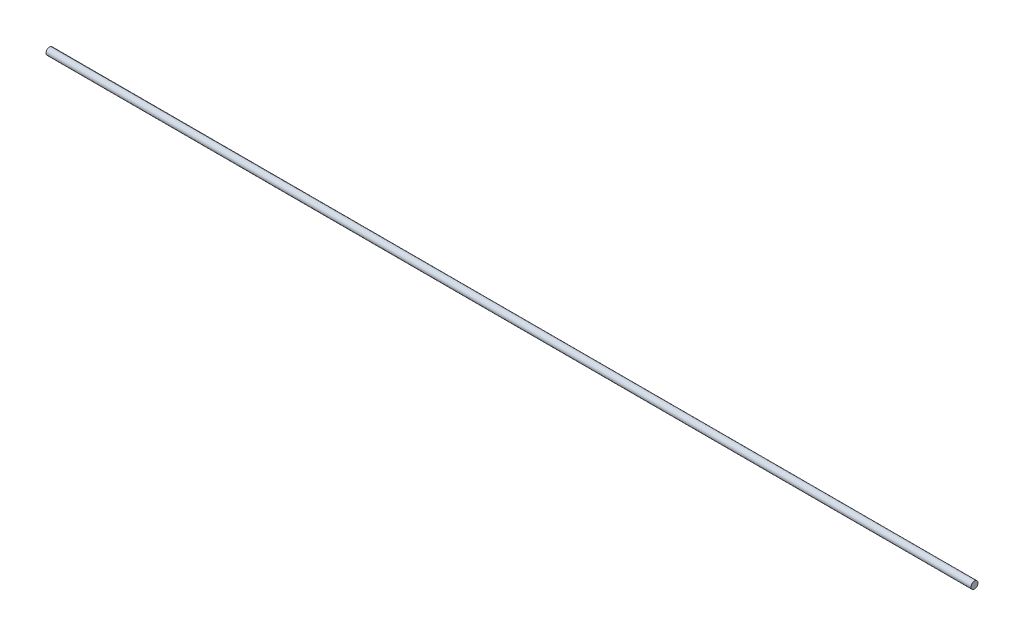
ISO-10303-21;
HEADER;
FILE_DESCRIPTION(('STEP AP214'),'2;1');
FILE_NAME('part.step','',(''),(''),'','','');
FILE_SCHEMA(('AUTOMOTIVE_DESIGN { 1 0 10303 214 1 1 1 1 }'));
ENDSEC;
DATA;
#1=APPLICATION_CONTEXT('core data for automotive mechanical design processes');
#2=APPLICATION_PROTOCOL_DEFINITION('international standard','automotive_design',2000,#1);
#3=PRODUCT_CONTEXT('',#1,'mechanical');
#4=PRODUCT('Part','Part','',(#3));
#5=PRODUCT_RELATED_PRODUCT_CATEGORY('part','',(#4));
#6=PRODUCT_DEFINITION_FORMATION('','',#4);
#7=PRODUCT_DEFINITION_CONTEXT('part definition',#1,'design');
#8=PRODUCT_DEFINITION('design','',#6,#7);
#9=PRODUCT_DEFINITION_SHAPE('','',#8);
#10=(LENGTH_UNIT() NAMED_UNIT(*) SI_UNIT(.MILLI.,.METRE.));
#11=(NAMED_UNIT(*) PLANE_ANGLE_UNIT() SI_UNIT($,.RADIAN.));
#12=(NAMED_UNIT(*) SI_UNIT($,.STERADIAN.) SOLID_ANGLE_UNIT());
#13=UNCERTAINTY_MEASURE_WITH_UNIT(LENGTH_MEASURE(1.E-05),#10,'distance_accuracy_value','');
#14=(GEOMETRIC_REPRESENTATION_CONTEXT(3) GLOBAL_UNCERTAINTY_ASSIGNED_CONTEXT((#13)) GLOBAL_UNIT_ASSIGNED_CONTEXT((#10,
#11,#12)) REPRESENTATION_CONTEXT('',''));
#15=CARTESIAN_POINT('',(0.,0.,0.));
#16=DIRECTION('',(0.,0.,1.));
#17=DIRECTION('',(1.,0.,0.));
#18=AXIS2_PLACEMENT_3D('',#15,#16,#17);
#19=CARTESIAN_POINT('',(838.2,0.,0.));
#20=DIRECTION('',(-1.,0.,0.));
#21=DIRECTION('',(0.,0.,1.));
#22=AXIS2_PLACEMENT_3D('',#19,#20,#21);
#23=CYLINDRICAL_SURFACE('',#22,3.175);
#24=CARTESIAN_POINT('',(838.2,0.,0.));
#25=DIRECTION('',(1.,0.,0.));
#26=DIRECTION('',(0.,0.,-1.));
#27=AXIS2_PLACEMENT_3D('',#24,#25,#26);
#28=CIRCLE('',#27,3.175);
#29=CARTESIAN_POINT('',(838.2,0.,-3.175));
#30=VERTEX_POINT('',#29);
#31=EDGE_CURVE('E10',#30,#30,#28,.T.);
#32=ORIENTED_EDGE('',*,*,#31,.F.);
#33=EDGE_LOOP('',(#32));
#34=FACE_BOUND('',#33,.T.);
#35=CARTESIAN_POINT('',(0.,0.,0.));
#36=DIRECTION('',(1.,0.,0.));
#37=DIRECTION('',(0.,0.,-1.));
#38=AXIS2_PLACEMENT_3D('',#35,#36,#37);
#39=CIRCLE('',#38,3.175);
#40=CARTESIAN_POINT('',(0.,0.,-3.175));
#41=VERTEX_POINT('',#40);
#42=EDGE_CURVE('E40',#41,#41,#39,.T.);
#43=ORIENTED_EDGE('',*,*,#42,.T.);
#44=EDGE_LOOP('',(#43));
#45=FACE_BOUND('',#44,.T.);
#46=ADVANCED_FACE('F37',(#34,#45),#23,.T.);
#47=CARTESIAN_POINT('',(838.2,0.,0.));
#48=DIRECTION('',(1.,0.,0.));
#49=DIRECTION('',(0.,0.,-1.));
#50=AXIS2_PLACEMENT_3D('',#47,#48,#49);
#51=PLANE('',#50);
#52=ORIENTED_EDGE('',*,*,#31,.T.);
#53=EDGE_LOOP('',(#52));
#54=FACE_BOUND('',#53,.T.);
#55=ADVANCED_FACE('F54',(#54),#51,.T.);
#56=CARTESIAN_POINT('',(0.,0.,0.));
#57=DIRECTION('',(1.,0.,0.));
#58=DIRECTION('',(0.,0.,-1.));
#59=AXIS2_PLACEMENT_3D('',#56,#57,#58);
#60=PLANE('',#59);
#61=ORIENTED_EDGE('',*,*,#42,.F.);
#62=EDGE_LOOP('',(#61));
#63=FACE_BOUND('',#62,.T.);
#64=ADVANCED_FACE('F52',(#63),#60,.F.);
#65=CLOSED_SHELL('',(#46,#55,#64));
#66=MANIFOLD_SOLID_BREP('B2',#65);
#67=ADVANCED_BREP_SHAPE_REPRESENTATION('',(#18,#66),#14);
#68=SHAPE_DEFINITION_REPRESENTATION(#9,#67);
ENDSEC;
END-ISO-10303-21;
